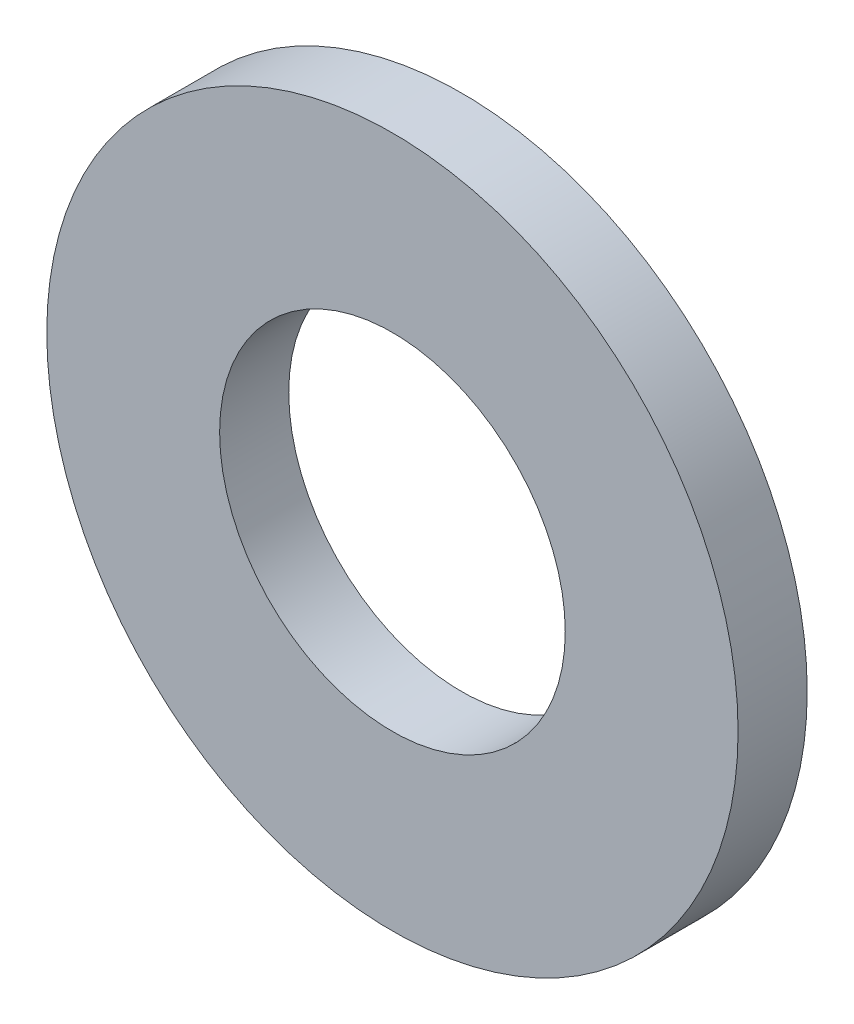
ISO-10303-21;
HEADER;
FILE_DESCRIPTION(('STEP AP214'),'2;1');
FILE_NAME('part.step','',(''),(''),'','','');
FILE_SCHEMA(('AUTOMOTIVE_DESIGN { 1 0 10303 214 1 1 1 1 }'));
ENDSEC;
DATA;
#1=APPLICATION_CONTEXT('core data for automotive mechanical design processes');
#2=APPLICATION_PROTOCOL_DEFINITION('international standard','automotive_design',2000,#1);
#3=PRODUCT_CONTEXT('',#1,'mechanical');
#4=PRODUCT('Part','Part','',(#3));
#5=PRODUCT_RELATED_PRODUCT_CATEGORY('part','',(#4));
#6=PRODUCT_DEFINITION_FORMATION('','',#4);
#7=PRODUCT_DEFINITION_CONTEXT('part definition',#1,'design');
#8=PRODUCT_DEFINITION('design','',#6,#7);
#9=PRODUCT_DEFINITION_SHAPE('','',#8);
#10=(LENGTH_UNIT() NAMED_UNIT(*) SI_UNIT(.MILLI.,.METRE.));
#11=(NAMED_UNIT(*) PLANE_ANGLE_UNIT() SI_UNIT($,.RADIAN.));
#12=(NAMED_UNIT(*) SI_UNIT($,.STERADIAN.) SOLID_ANGLE_UNIT());
#13=UNCERTAINTY_MEASURE_WITH_UNIT(LENGTH_MEASURE(1.E-05),#10,'distance_accuracy_value','');
#14=(GEOMETRIC_REPRESENTATION_CONTEXT(3) GLOBAL_UNCERTAINTY_ASSIGNED_CONTEXT((#13)) GLOBAL_UNIT_ASSIGNED_CONTEXT((#10,
#11,#12)) REPRESENTATION_CONTEXT('',''));
#15=CARTESIAN_POINT('',(0.,0.,0.));
#16=DIRECTION('',(0.,0.,1.));
#17=DIRECTION('',(1.,0.,0.));
#18=AXIS2_PLACEMENT_3D('',#15,#16,#17);
#19=CARTESIAN_POINT('',(0.,0.,1.));
#20=DIRECTION('',(0.,0.,1.));
#21=DIRECTION('',(1.,0.,0.));
#22=AXIS2_PLACEMENT_3D('',#19,#20,#21);
#23=PLANE('',#22);
#24=CARTESIAN_POINT('',(0.,0.,1.));
#25=DIRECTION('',(0.,0.,1.));
#26=DIRECTION('',(1.,0.,0.));
#27=AXIS2_PLACEMENT_3D('',#24,#25,#26);
#28=CIRCLE('',#27,5.);
#29=CARTESIAN_POINT('',(5.,0.,1.));
#30=VERTEX_POINT('',#29);
#31=EDGE_CURVE('E26',#30,#30,#28,.F.);
#32=ORIENTED_EDGE('',*,*,#31,.F.);
#33=EDGE_LOOP('',(#32));
#34=FACE_BOUND('',#33,.T.);
#35=CARTESIAN_POINT('',(0.,0.,1.));
#36=DIRECTION('',(0.,0.,1.));
#37=DIRECTION('',(1.,0.,0.));
#38=AXIS2_PLACEMENT_3D('',#35,#36,#37);
#39=CIRCLE('',#38,2.5);
#40=CARTESIAN_POINT('',(2.5,0.,1.));
#41=VERTEX_POINT('',#40);
#42=EDGE_CURVE('E17',#41,#41,#39,.F.);
#43=ORIENTED_EDGE('',*,*,#42,.T.);
#44=EDGE_LOOP('',(#43));
#45=FACE_BOUND('',#44,.T.);
#46=ADVANCED_FACE('F14',(#34,#45),#23,.T.);
#47=CARTESIAN_POINT('',(0.,0.,0.));
#48=DIRECTION('',(0.,0.,1.));
#49=DIRECTION('',(1.,0.,0.));
#50=AXIS2_PLACEMENT_3D('',#47,#48,#49);
#51=CYLINDRICAL_SURFACE('',#50,2.5);
#52=CARTESIAN_POINT('',(0.,0.,0.));
#53=DIRECTION('',(0.,0.,1.));
#54=DIRECTION('',(1.,0.,0.));
#55=AXIS2_PLACEMENT_3D('',#52,#53,#54);
#56=CIRCLE('',#55,2.5);
#57=CARTESIAN_POINT('',(2.5,0.,0.));
#58=VERTEX_POINT('',#57);
#59=EDGE_CURVE('E21',#58,#58,#56,.F.);
#60=ORIENTED_EDGE('',*,*,#59,.T.);
#61=EDGE_LOOP('',(#60));
#62=FACE_BOUND('',#61,.T.);
#63=ORIENTED_EDGE('',*,*,#42,.F.);
#64=EDGE_LOOP('',(#63));
#65=FACE_BOUND('',#64,.T.);
#66=ADVANCED_FACE('F35',(#62,#65),#51,.F.);
#67=CARTESIAN_POINT('',(0.,0.,0.));
#68=DIRECTION('',(0.,0.,1.));
#69=DIRECTION('',(1.,0.,0.));
#70=AXIS2_PLACEMENT_3D('',#67,#68,#69);
#71=CYLINDRICAL_SURFACE('',#70,5.);
#72=CARTESIAN_POINT('',(0.,0.,0.));
#73=DIRECTION('',(0.,0.,1.));
#74=DIRECTION('',(1.,0.,0.));
#75=AXIS2_PLACEMENT_3D('',#72,#73,#74);
#76=CIRCLE('',#75,5.);
#77=CARTESIAN_POINT('',(5.,0.,0.));
#78=VERTEX_POINT('',#77);
#79=EDGE_CURVE('E10',#78,#78,#76,.T.);
#80=ORIENTED_EDGE('',*,*,#79,.T.);
#81=EDGE_LOOP('',(#80));
#82=FACE_BOUND('',#81,.T.);
#83=ORIENTED_EDGE('',*,*,#31,.T.);
#84=EDGE_LOOP('',(#83));
#85=FACE_BOUND('',#84,.T.);
#86=ADVANCED_FACE('F37',(#82,#85),#71,.T.);
#87=CARTESIAN_POINT('',(0.,0.,0.));
#88=DIRECTION('',(0.,0.,1.));
#89=DIRECTION('',(1.,0.,0.));
#90=AXIS2_PLACEMENT_3D('',#87,#88,#89);
#91=PLANE('',#90);
#92=ORIENTED_EDGE('',*,*,#79,.F.);
#93=EDGE_LOOP('',(#92));
#94=FACE_BOUND('',#93,.T.);
#95=ORIENTED_EDGE('',*,*,#59,.F.);
#96=EDGE_LOOP('',(#95));
#97=FACE_BOUND('',#96,.T.);
#98=ADVANCED_FACE('F44',(#94,#97),#91,.F.);
#99=CLOSED_SHELL('',(#46,#66,#86,#98));
#100=MANIFOLD_SOLID_BREP('B1',#99);
#101=ADVANCED_BREP_SHAPE_REPRESENTATION('',(#18,#100),#14);
#102=SHAPE_DEFINITION_REPRESENTATION(#9,#101);
ENDSEC;
END-ISO-10303-21;
